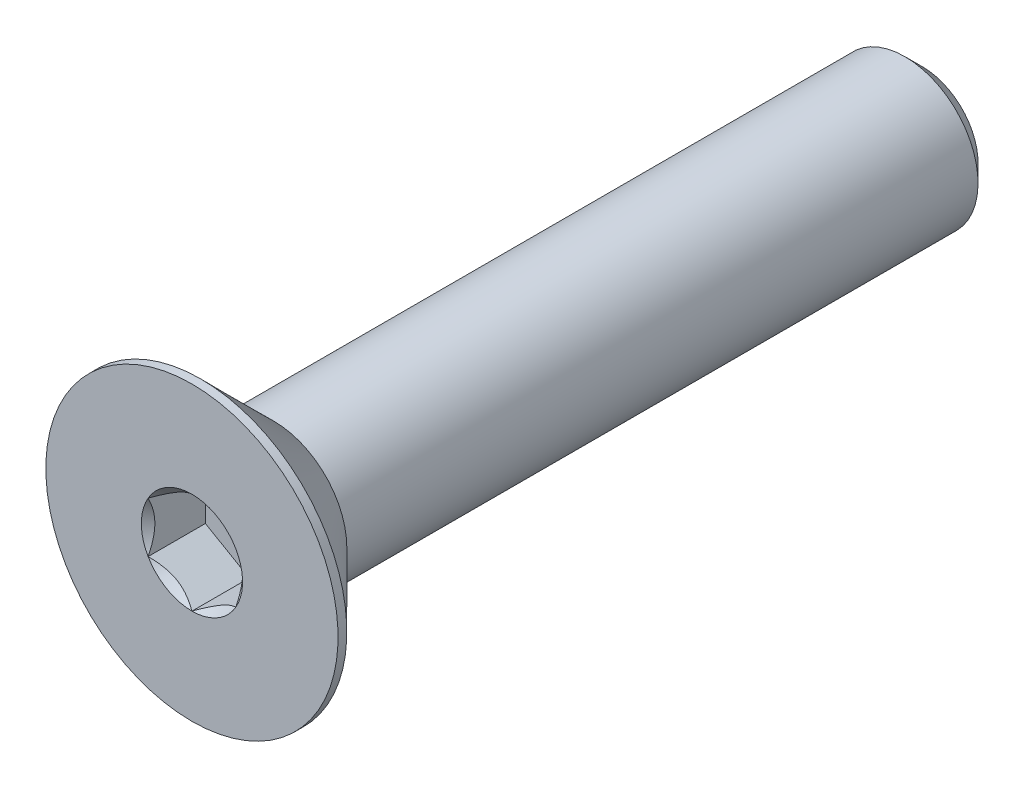
ISO-10303-21;
HEADER;
FILE_DESCRIPTION(('STEP AP214'),'2;1');
FILE_NAME('part.step','',(''),(''),'','','');
FILE_SCHEMA(('AUTOMOTIVE_DESIGN { 1 0 10303 214 1 1 1 1 }'));
ENDSEC;
DATA;
#1=APPLICATION_CONTEXT('core data for automotive mechanical design processes');
#2=APPLICATION_PROTOCOL_DEFINITION('international standard','automotive_design',2000,#1);
#3=PRODUCT_CONTEXT('',#1,'mechanical');
#4=PRODUCT('Part','Part','',(#3));
#5=PRODUCT_RELATED_PRODUCT_CATEGORY('part','',(#4));
#6=PRODUCT_DEFINITION_FORMATION('','',#4);
#7=PRODUCT_DEFINITION_CONTEXT('part definition',#1,'design');
#8=PRODUCT_DEFINITION('design','',#6,#7);
#9=PRODUCT_DEFINITION_SHAPE('','',#8);
#10=(LENGTH_UNIT() NAMED_UNIT(*) SI_UNIT(.MILLI.,.METRE.));
#11=(NAMED_UNIT(*) PLANE_ANGLE_UNIT() SI_UNIT($,.RADIAN.));
#12=(NAMED_UNIT(*) SI_UNIT($,.STERADIAN.) SOLID_ANGLE_UNIT());
#13=UNCERTAINTY_MEASURE_WITH_UNIT(LENGTH_MEASURE(1.E-05),#10,'distance_accuracy_value','');
#14=(GEOMETRIC_REPRESENTATION_CONTEXT(3) GLOBAL_UNCERTAINTY_ASSIGNED_CONTEXT((#13)) GLOBAL_UNIT_ASSIGNED_CONTEXT((#10,
#11,#12)) REPRESENTATION_CONTEXT('',''));
#15=CARTESIAN_POINT('',(0.,0.,0.));
#16=DIRECTION('',(0.,0.,1.));
#17=DIRECTION('',(1.,0.,0.));
#18=AXIS2_PLACEMENT_3D('',#15,#16,#17);
#19=CARTESIAN_POINT('',(0.,0.,-25.));
#20=DIRECTION('',(0.,0.,-1.));
#21=DIRECTION('',(0.,1.,0.));
#22=AXIS2_PLACEMENT_3D('',#19,#20,#21);
#23=CYLINDRICAL_SURFACE('',#22,2.5);
#24=CARTESIAN_POINT('',(0.,0.,-24.4));
#25=DIRECTION('',(0.,0.,-1.));
#26=DIRECTION('',(0.,1.,0.));
#27=AXIS2_PLACEMENT_3D('',#24,#25,#26);
#28=CIRCLE('',#27,2.5);
#29=CARTESIAN_POINT('',(0.,2.50000000000003,-24.4));
#30=VERTEX_POINT('',#29);
#31=EDGE_CURVE('E60',#30,#30,#28,.F.);
#32=CARTESIAN_POINT('',(0.,0.,-2.79999999999997));
#33=DIRECTION('',(0.,0.,1.));
#34=DIRECTION('',(0.,-1.,0.));
#35=AXIS2_PLACEMENT_3D('',#32,#33,#34);
#36=CIRCLE('',#35,2.50000000000001);
#37=CARTESIAN_POINT('',(0.,2.50000000000003,-2.79999999999997));
#38=VERTEX_POINT('',#37);
#39=EDGE_CURVE('E178',#38,#38,#36,.T.);
#40=CARTESIAN_POINT('',(0.,2.50000000000003,-24.4));
#41=CARTESIAN_POINT('',(0.,2.50000000000003,-24.175));
#42=CARTESIAN_POINT('',(0.,2.50000000000003,-23.95));
#43=CARTESIAN_POINT('',(0.,2.50000000000003,-23.5));
#44=CARTESIAN_POINT('',(0.,2.50000000000003,-23.275));
#45=CARTESIAN_POINT('',(0.,2.50000000000003,-22.825));
#46=CARTESIAN_POINT('',(0.,2.50000000000003,-22.6));
#47=CARTESIAN_POINT('',(0.,2.50000000000003,-22.15));
#48=CARTESIAN_POINT('',(0.,2.50000000000003,-21.925));
#49=CARTESIAN_POINT('',(0.,2.50000000000003,-21.475));
#50=CARTESIAN_POINT('',(0.,2.50000000000003,-21.25));
#51=CARTESIAN_POINT('',(0.,2.50000000000003,-20.8));
#52=CARTESIAN_POINT('',(0.,2.50000000000003,-20.575));
#53=CARTESIAN_POINT('',(0.,2.50000000000003,-20.125));
#54=CARTESIAN_POINT('',(0.,2.50000000000003,-19.9));
#55=CARTESIAN_POINT('',(0.,2.50000000000003,-19.45));
#56=CARTESIAN_POINT('',(0.,2.50000000000003,-19.225));
#57=CARTESIAN_POINT('',(0.,2.50000000000003,-18.775));
#58=CARTESIAN_POINT('',(0.,2.50000000000003,-18.55));
#59=CARTESIAN_POINT('',(0.,2.50000000000003,-18.1));
#60=CARTESIAN_POINT('',(0.,2.50000000000003,-17.875));
#61=CARTESIAN_POINT('',(0.,2.50000000000003,-17.425));
#62=CARTESIAN_POINT('',(0.,2.50000000000003,-17.2));
#63=CARTESIAN_POINT('',(0.,2.50000000000003,-16.75));
#64=CARTESIAN_POINT('',(0.,2.50000000000003,-16.525));
#65=CARTESIAN_POINT('',(0.,2.50000000000003,-16.075));
#66=CARTESIAN_POINT('',(0.,2.50000000000003,-15.85));
#67=CARTESIAN_POINT('',(0.,2.50000000000003,-15.4));
#68=CARTESIAN_POINT('',(0.,2.50000000000003,-15.175));
#69=CARTESIAN_POINT('',(0.,2.50000000000003,-14.725));
#70=CARTESIAN_POINT('',(0.,2.50000000000003,-14.5));
#71=CARTESIAN_POINT('',(0.,2.50000000000003,-14.05));
#72=CARTESIAN_POINT('',(0.,2.50000000000003,-13.825));
#73=CARTESIAN_POINT('',(0.,2.50000000000003,-13.375));
#74=CARTESIAN_POINT('',(0.,2.50000000000003,-13.15));
#75=CARTESIAN_POINT('',(0.,2.50000000000003,-12.7));
#76=CARTESIAN_POINT('',(0.,2.50000000000003,-12.475));
#77=CARTESIAN_POINT('',(0.,2.50000000000003,-12.025));
#78=CARTESIAN_POINT('',(0.,2.50000000000003,-11.8));
#79=CARTESIAN_POINT('',(0.,2.50000000000003,-11.35));
#80=CARTESIAN_POINT('',(0.,2.50000000000003,-11.125));
#81=CARTESIAN_POINT('',(0.,2.50000000000003,-10.675));
#82=CARTESIAN_POINT('',(0.,2.50000000000003,-10.45));
#83=CARTESIAN_POINT('',(0.,2.50000000000003,-9.99999999999998));
#84=CARTESIAN_POINT('',(0.,2.50000000000003,-9.77499999999998));
#85=CARTESIAN_POINT('',(0.,2.50000000000003,-9.32499999999998));
#86=CARTESIAN_POINT('',(0.,2.50000000000003,-9.09999999999998));
#87=CARTESIAN_POINT('',(0.,2.50000000000003,-8.64999999999998));
#88=CARTESIAN_POINT('',(0.,2.50000000000003,-8.42499999999998));
#89=CARTESIAN_POINT('',(0.,2.50000000000003,-7.97499999999997));
#90=CARTESIAN_POINT('',(0.,2.50000000000003,-7.74999999999997));
#91=CARTESIAN_POINT('',(0.,2.50000000000003,-7.29999999999997));
#92=CARTESIAN_POINT('',(0.,2.50000000000003,-7.07499999999998));
#93=CARTESIAN_POINT('',(0.,2.50000000000003,-6.62499999999998));
#94=CARTESIAN_POINT('',(0.,2.50000000000003,-6.39999999999998));
#95=CARTESIAN_POINT('',(0.,2.50000000000003,-5.94999999999998));
#96=CARTESIAN_POINT('',(0.,2.50000000000003,-5.72499999999997));
#97=CARTESIAN_POINT('',(0.,2.50000000000003,-5.27499999999997));
#98=CARTESIAN_POINT('',(0.,2.50000000000003,-5.04999999999997));
#99=CARTESIAN_POINT('',(0.,2.50000000000003,-4.59999999999997));
#100=CARTESIAN_POINT('',(0.,2.50000000000003,-4.37499999999998));
#101=CARTESIAN_POINT('',(0.,2.50000000000003,-3.92499999999998));
#102=CARTESIAN_POINT('',(0.,2.50000000000003,-3.69999999999998));
#103=CARTESIAN_POINT('',(0.,2.50000000000003,-3.24999999999997));
#104=CARTESIAN_POINT('',(0.,2.50000000000003,-3.02499999999997));
#105=CARTESIAN_POINT('',(0.,2.50000000000003,-2.79999999999997));
#106=B_SPLINE_CURVE_WITH_KNOTS('',3,(#40,#41,#42,#43,#44,#45,#46,#47,#48,#49,#50,#51,#52,#53,
#54,#55,#56,#57,#58,#59,#60,#61,#62,#63,#64,#65,#66,#67,#68,#69,#70,#71,#72,#73,#74,#75,#76,#77,
#78,#79,#80,#81,#82,#83,#84,#85,#86,#87,#88,#89,#90,#91,#92,#93,#94,#95,#96,#97,#98,#99,#100,
#101,#102,#103,#104,#105),.UNSPECIFIED.,.F.,.F.,(4,2,2,2,2,2,2,2,2,2,2,2,2,2,2,2,2,2,2,2,2,2,2,
2,2,2,2,2,2,2,2,2,4),(0.,0.675000000000002,1.35,2.025,2.7,3.375,4.05,4.725,5.4,6.075,6.75,7.425,
8.1,8.775,9.45,10.125,10.8,11.475,12.15,12.825,13.5,14.175,14.85,15.525,16.2,16.875,17.55,
18.225,18.9,19.575,20.25,20.925,21.6),.UNSPECIFIED.);
#107=EDGE_CURVE('BSEAM46',#30,#38,#106,.T.);
#108=ORIENTED_EDGE('',*,*,#31,.T.);
#109=ORIENTED_EDGE('',*,*,#39,.F.);
#110=ORIENTED_EDGE('',*,*,#107,.T.);
#111=ORIENTED_EDGE('',*,*,#107,.F.);
#112=EDGE_LOOP('',(#108,#110,#109,#111));
#113=FACE_BOUND('',#112,.T.);
#114=ADVANCED_FACE('F46',(#113),#23,.T.);
#115=CARTESIAN_POINT('',(0.,-2.5,-25.));
#116=DIRECTION('',(0.,0.,-1.));
#117=DIRECTION('',(0.,1.,0.));
#118=AXIS2_PLACEMENT_3D('',#115,#116,#117);
#119=PLANE('',#118);
#120=CARTESIAN_POINT('',(0.,0.,-25.));
#121=DIRECTION('',(0.,0.,-1.));
#122=DIRECTION('',(0.,1.,0.));
#123=AXIS2_PLACEMENT_3D('',#120,#121,#122);
#124=CIRCLE('',#123,1.90000000000001);
#125=CARTESIAN_POINT('',(0.,1.90000000000003,-25.));
#126=VERTEX_POINT('',#125);
#127=EDGE_CURVE('E187',#126,#126,#124,.T.);
#128=ORIENTED_EDGE('',*,*,#127,.T.);
#129=EDGE_LOOP('',(#128));
#130=FACE_BOUND('',#129,.T.);
#131=ADVANCED_FACE('F197',(#130),#119,.T.);
#132=CARTESIAN_POINT('',(0.,0.,-25.));
#133=DIRECTION('',(0.,0.,1.));
#134=DIRECTION('',(0.,-1.,0.));
#135=AXIS2_PLACEMENT_3D('',#132,#133,#134);
#136=CONICAL_SURFACE('',#135,1.90000000000001,0.785398163397448);
#137=ORIENTED_EDGE('',*,*,#31,.F.);
#138=EDGE_LOOP('',(#137));
#139=FACE_BOUND('',#138,.T.);
#140=ORIENTED_EDGE('',*,*,#127,.F.);
#141=EDGE_LOOP('',(#140));
#142=FACE_BOUND('',#141,.T.);
#143=ADVANCED_FACE('F48',(#139,#142),#136,.T.);
#144=CARTESIAN_POINT('',(0.,0.,0.));
#145=DIRECTION('',(0.,0.,1.));
#146=DIRECTION('',(0.,-1.,0.));
#147=AXIS2_PLACEMENT_3D('',#144,#145,#146);
#148=CYLINDRICAL_SURFACE('',#147,5.);
#149=CARTESIAN_POINT('',(0.,0.,0.));
#150=DIRECTION('',(0.,0.,1.));
#151=DIRECTION('',(0.,-1.,0.));
#152=AXIS2_PLACEMENT_3D('',#149,#150,#151);
#153=CIRCLE('',#152,5.);
#154=CARTESIAN_POINT('',(0.,-5.,0.));
#155=VERTEX_POINT('',#154);
#156=EDGE_CURVE('E184',#155,#155,#153,.T.);
#157=CARTESIAN_POINT('',(0.,0.,-0.300000000000022));
#158=DIRECTION('',(0.,0.,1.));
#159=DIRECTION('',(0.,-1.,0.));
#160=AXIS2_PLACEMENT_3D('',#157,#158,#159);
#161=CIRCLE('',#160,5.);
#162=CARTESIAN_POINT('',(0.,-5.,-0.300000000000017));
#163=VERTEX_POINT('',#162);
#164=EDGE_CURVE('E181',#163,#163,#161,.T.);
#165=CARTESIAN_POINT('',(0.,-5.,0.));
#166=CARTESIAN_POINT('',(0.,-5.,-0.00312499999999512));
#167=CARTESIAN_POINT('',(0.,-5.,-0.00624999999999535));
#168=CARTESIAN_POINT('',(0.,-5.,-0.0124999999999958));
#169=CARTESIAN_POINT('',(0.,-5.,-0.0156249999999961));
#170=CARTESIAN_POINT('',(0.,-5.,-0.0218749999999965));
#171=CARTESIAN_POINT('',(0.,-5.,-0.0249999999999968));
#172=CARTESIAN_POINT('',(0.,-5.,-0.0312499999999972));
#173=CARTESIAN_POINT('',(0.,-5.,-0.0343749999999975));
#174=CARTESIAN_POINT('',(0.,-5.,-0.0406249999999979));
#175=CARTESIAN_POINT('',(0.,-5.,-0.0437499999999982));
#176=CARTESIAN_POINT('',(0.,-5.,-0.0499999999999986));
#177=CARTESIAN_POINT('',(0.,-5.,-0.0531249999999989));
#178=CARTESIAN_POINT('',(0.,-5.,-0.0593749999999993));
#179=CARTESIAN_POINT('',(0.,-5.,-0.0624999999999996));
#180=CARTESIAN_POINT('',(0.,-5.,-0.06875));
#181=CARTESIAN_POINT('',(0.,-5.,-0.0718750000000003));
#182=CARTESIAN_POINT('',(0.,-5.,-0.0781250000000007));
#183=CARTESIAN_POINT('',(0.,-5.,-0.081250000000001));
#184=CARTESIAN_POINT('',(0.,-5.,-0.0875000000000014));
#185=CARTESIAN_POINT('',(0.,-5.,-0.0906250000000017));
#186=CARTESIAN_POINT('',(0.,-5.,-0.0968750000000021));
#187=CARTESIAN_POINT('',(0.,-5.,-0.100000000000002));
#188=CARTESIAN_POINT('',(0.,-5.,-0.106250000000003));
#189=CARTESIAN_POINT('',(0.,-5.,-0.109375000000003));
#190=CARTESIAN_POINT('',(0.,-5.,-0.115625000000004));
#191=CARTESIAN_POINT('',(0.,-5.,-0.118750000000004));
#192=CARTESIAN_POINT('',(0.,-5.,-0.125000000000004));
#193=CARTESIAN_POINT('',(0.,-5.,-0.128125000000004));
#194=CARTESIAN_POINT('',(0.,-5.,-0.134375000000005));
#195=CARTESIAN_POINT('',(0.,-5.,-0.137500000000005));
#196=CARTESIAN_POINT('',(0.,-5.,-0.143750000000006));
#197=CARTESIAN_POINT('',(0.,-5.,-0.146875000000006));
#198=CARTESIAN_POINT('',(0.,-5.,-0.153125000000006));
#199=CARTESIAN_POINT('',(0.,-5.,-0.156250000000007));
#200=CARTESIAN_POINT('',(0.,-5.,-0.162500000000007));
#201=CARTESIAN_POINT('',(0.,-5.,-0.165625000000007));
#202=CARTESIAN_POINT('',(0.,-5.,-0.171875000000008));
#203=CARTESIAN_POINT('',(0.,-5.,-0.175000000000008));
#204=CARTESIAN_POINT('',(0.,-5.,-0.181250000000008));
#205=CARTESIAN_POINT('',(0.,-5.,-0.184375000000009));
#206=CARTESIAN_POINT('',(0.,-5.,-0.190625000000009));
#207=CARTESIAN_POINT('',(0.,-5.,-0.193750000000009));
#208=CARTESIAN_POINT('',(0.,-5.,-0.20000000000001));
#209=CARTESIAN_POINT('',(0.,-5.,-0.20312500000001));
#210=CARTESIAN_POINT('',(0.,-5.,-0.209375000000011));
#211=CARTESIAN_POINT('',(0.,-5.,-0.212500000000011));
#212=CARTESIAN_POINT('',(0.,-5.,-0.218750000000011));
#213=CARTESIAN_POINT('',(0.,-5.,-0.221875000000011));
#214=CARTESIAN_POINT('',(0.,-5.,-0.228125000000012));
#215=CARTESIAN_POINT('',(0.,-5.,-0.231250000000012));
#216=CARTESIAN_POINT('',(0.,-5.,-0.237500000000013));
#217=CARTESIAN_POINT('',(0.,-5.,-0.240625000000013));
#218=CARTESIAN_POINT('',(0.,-5.,-0.246875000000013));
#219=CARTESIAN_POINT('',(0.,-5.,-0.250000000000014));
#220=CARTESIAN_POINT('',(0.,-5.,-0.256250000000014));
#221=CARTESIAN_POINT('',(0.,-5.,-0.259375000000014));
#222=CARTESIAN_POINT('',(0.,-5.,-0.265625000000015));
#223=CARTESIAN_POINT('',(0.,-5.,-0.268750000000015));
#224=CARTESIAN_POINT('',(0.,-5.,-0.275000000000016));
#225=CARTESIAN_POINT('',(0.,-5.,-0.278125000000016));
#226=CARTESIAN_POINT('',(0.,-5.,-0.284375000000016));
#227=CARTESIAN_POINT('',(0.,-5.,-0.287500000000016));
#228=CARTESIAN_POINT('',(0.,-5.,-0.293750000000017));
#229=CARTESIAN_POINT('',(0.,-5.,-0.296875000000017));
#230=CARTESIAN_POINT('',(0.,-5.,-0.300000000000017));
#231=B_SPLINE_CURVE_WITH_KNOTS('',3,(#165,#166,#167,#168,#169,#170,#171,#172,#173,#174,#175,
#176,#177,#178,#179,#180,#181,#182,#183,#184,#185,#186,#187,#188,#189,#190,#191,#192,#193,#194,
#195,#196,#197,#198,#199,#200,#201,#202,#203,#204,#205,#206,#207,#208,#209,#210,#211,#212,#213,
#214,#215,#216,#217,#218,#219,#220,#221,#222,#223,#224,#225,#226,#227,#228,#229,#230),
.UNSPECIFIED.,.F.,.F.,(4,2,2,2,2,2,2,2,2,2,2,2,2,2,2,2,2,2,2,2,2,2,2,2,2,2,2,2,2,2,2,2,4),(0.,
0.0093750000000007,0.0187500000000014,0.0281250000000021,0.0375000000000028,0.0468750000000035,
0.0562500000000042,0.0656250000000049,0.0750000000000056,0.0843750000000063,0.093750000000007,
0.103125000000008,0.112500000000008,0.121875000000009,0.13125000000001,0.140625000000011,
0.150000000000011,0.159375000000012,0.168750000000013,0.178125000000013,0.187500000000014,
0.196875000000015,0.206250000000015,0.215625000000016,0.225000000000017,0.234375000000018,
0.243750000000018,0.253125000000019,0.26250000000002,0.27187500000002,0.281250000000021,
0.290625000000022,0.300000000000022),.UNSPECIFIED.);
#232=EDGE_CURVE('BSEAM196',#155,#163,#231,.T.);
#233=ORIENTED_EDGE('',*,*,#156,.F.);
#234=ORIENTED_EDGE('',*,*,#164,.T.);
#235=ORIENTED_EDGE('',*,*,#232,.T.);
#236=ORIENTED_EDGE('',*,*,#232,.F.);
#237=EDGE_LOOP('',(#233,#235,#234,#236));
#238=FACE_BOUND('',#237,.T.);
#239=ADVANCED_FACE('F196',(#238),#148,.T.);
#240=CARTESIAN_POINT('',(0.,0.,-2.79999999999997));
#241=DIRECTION('',(0.,0.,1.));
#242=DIRECTION('',(0.,-1.,0.));
#243=AXIS2_PLACEMENT_3D('',#240,#241,#242);
#244=CONICAL_SURFACE('',#243,2.50000000000001,0.78539816339745);
#245=ORIENTED_EDGE('',*,*,#164,.F.);
#246=EDGE_LOOP('',(#245));
#247=FACE_BOUND('',#246,.T.);
#248=ORIENTED_EDGE('',*,*,#39,.T.);
#249=EDGE_LOOP('',(#248));
#250=FACE_BOUND('',#249,.T.);
#251=ADVANCED_FACE('F207',(#247,#250),#244,.T.);
#252=CARTESIAN_POINT('',(0.,-2.5,0.));
#253=DIRECTION('',(0.,0.,1.));
#254=DIRECTION('',(0.,-1.,0.));
#255=AXIS2_PLACEMENT_3D('',#252,#253,#254);
#256=PLANE('',#255);
#257=CARTESIAN_POINT('',(0.,0.,0.));
#258=DIRECTION('',(0.,0.,1.));
#259=DIRECTION('',(1.,0.,0.));
#260=AXIS2_PLACEMENT_3D('',#257,#258,#259);
#261=CIRCLE('',#260,1.73205080756888);
#262=CARTESIAN_POINT('',(0.,-1.73205080756884,0.));
#263=VERTEX_POINT('',#262);
#264=CARTESIAN_POINT('',(1.49999999999997,-0.866025403784415,0.));
#265=VERTEX_POINT('',#264);
#266=EDGE_CURVE('E106',#263,#265,#261,.T.);
#267=ORIENTED_EDGE('',*,*,#266,.F.);
#268=CARTESIAN_POINT('',(-1.49999999999997,-0.866025403784443,0.));
#269=VERTEX_POINT('',#268);
#270=EDGE_CURVE('E66',#269,#263,#261,.T.);
#271=ORIENTED_EDGE('',*,*,#270,.F.);
#272=CARTESIAN_POINT('',(-1.50000000000003,0.866025403784471,0.));
#273=VERTEX_POINT('',#272);
#274=EDGE_CURVE('E148',#273,#269,#261,.T.);
#275=ORIENTED_EDGE('',*,*,#274,.F.);
#276=CARTESIAN_POINT('',(0.,1.73205080756891,0.));
#277=VERTEX_POINT('',#276);
#278=EDGE_CURVE('E73',#277,#273,#261,.T.);
#279=ORIENTED_EDGE('',*,*,#278,.F.);
#280=CARTESIAN_POINT('',(1.49999999999997,0.866025403784471,0.));
#281=VERTEX_POINT('',#280);
#282=EDGE_CURVE('E142',#281,#277,#261,.T.);
#283=ORIENTED_EDGE('',*,*,#282,.F.);
#284=EDGE_CURVE('E114',#265,#281,#261,.T.);
#285=ORIENTED_EDGE('',*,*,#284,.F.);
#286=EDGE_LOOP('',(#267,#271,#275,#279,#283,#285));
#287=FACE_BOUND('',#286,.T.);
#288=ORIENTED_EDGE('',*,*,#156,.T.);
#289=EDGE_LOOP('',(#288));
#290=FACE_BOUND('',#289,.T.);
#291=ADVANCED_FACE('F140',(#287,#290),#256,.T.);
#292=CARTESIAN_POINT('',(0.,0.,0.));
#293=DIRECTION('',(0.,0.,1.));
#294=DIRECTION('',(1.,0.,0.));
#295=AXIS2_PLACEMENT_3D('',#292,#293,#294);
#296=CONICAL_SURFACE('',#295,1.73205080756888,0.78539816339745);
#297=ORIENTED_EDGE('',*,*,#284,.T.);
#298=CARTESIAN_POINT('',(1.49999999999992,-1.7272081296969,0.555578516270749));
#299=CARTESIAN_POINT('',(1.4999999999999,-1.68515175699266,0.523829907857362));
#300=CARTESIAN_POINT('',(1.49999999999989,-1.64286104748672,0.492392593807306));
#301=CARTESIAN_POINT('',(1.49999999999989,-1.55771581035941,0.430269087556319));
#302=CARTESIAN_POINT('',(1.49999999999989,-1.51486114386666,0.39958308589211));
#303=CARTESIAN_POINT('',(1.49999999999989,-1.38468134151268,0.308407192427072));
#304=CARTESIAN_POINT('',(1.4999999999999,-1.29637976071652,0.249288343426689));
#305=CARTESIAN_POINT('',(1.49999999999988,-1.11121478730467,0.133230996316403));
#306=CARTESIAN_POINT('',(1.49999999999986,-1.01415038238168,0.076609558732883));
#307=CARTESIAN_POINT('',(1.49999999999992,-0.815173408897587,-0.0269631187344146));
#308=CARTESIAN_POINT('',(1.50000000000002,-0.713278669253228,-0.0739469584583163));
#309=CARTESIAN_POINT('',(1.49999999999995,-0.560333774943062,-0.131427331569222));
#310=CARTESIAN_POINT('',(1.49999999999991,-0.511547982948004,-0.147924612242851));
#311=CARTESIAN_POINT('',(1.49999999999988,-0.412798620136834,-0.177002487073126));
#312=CARTESIAN_POINT('',(1.49999999999989,-0.362834968437524,-0.189582811406095));
#313=CARTESIAN_POINT('',(1.49999999999989,-0.262863235444938,-0.209963805853348));
#314=CARTESIAN_POINT('',(1.49999999999986,-0.212872113807978,-0.217846367254157));
#315=CARTESIAN_POINT('',(1.49999999999992,-0.112355243569493,-0.228677936031088));
#316=CARTESIAN_POINT('',(1.5,-0.0618295883725674,-0.231627791475674));
#317=CARTESIAN_POINT('',(1.5,0.0374291733324539,-0.232375142275173));
#318=CARTESIAN_POINT('',(1.49999999999992,0.0861609672003699,-0.230355266442008));
#319=CARTESIAN_POINT('',(1.49999999999986,0.183206937768894,-0.221677447103365));
#320=CARTESIAN_POINT('',(1.49999999999989,0.231521073438332,-0.215019053031647));
#321=CARTESIAN_POINT('',(1.49999999999989,0.328199853425492,-0.197314755877524));
#322=CARTESIAN_POINT('',(1.49999999999988,0.376550616310382,-0.186194188743062));
#323=CARTESIAN_POINT('',(1.49999999999991,0.472195697125641,-0.160156585951373));
#324=CARTESIAN_POINT('',(1.49999999999995,0.519490103092774,-0.145239867959124));
#325=CARTESIAN_POINT('',(1.50000000000002,0.668391282696648,-0.0926647764039492));
#326=CARTESIAN_POINT('',(1.49999999999992,0.767878709508593,-0.0490187125280854));
#327=CARTESIAN_POINT('',(1.49999999999986,0.962179866690772,0.0480229945930116));
#328=CARTESIAN_POINT('',(1.49999999999988,1.05697519961448,0.101453665089462));
#329=CARTESIAN_POINT('',(1.4999999999999,1.23814273533386,0.211685852004496));
#330=CARTESIAN_POINT('',(1.4999999999999,1.32469942181292,0.268187920698531));
#331=CARTESIAN_POINT('',(1.49999999999989,1.45222331290676,0.355534301578598));
#332=CARTESIAN_POINT('',(1.49999999999988,1.49418091978758,0.384957758679985));
#333=CARTESIAN_POINT('',(1.4999999999999,1.5775227293148,0.444582821830408));
#334=CARTESIAN_POINT('',(1.49999999999992,1.61890708647358,0.474784211664379));
#335=CARTESIAN_POINT('',(1.49999999999997,1.66005278019499,0.505308178609387));
#336=B_SPLINE_CURVE_WITH_KNOTS('',3,(#298,#299,#300,#301,#302,#303,#304,#305,#306,#307,#308,
#309,#310,#311,#312,#313,#314,#315,#316,#317,#318,#319,#320,#321,#322,#323,#324,#325,#326,#327,
#328,#329,#330,#331,#332,#333,#334,#335),.UNSPECIFIED.,.F.,.F.,(4,2,2,2,2,2,2,2,2,2,2,2,2,2,2,2,
2,2,4),(0.,0.158079548982684,0.316198780993969,0.634850417346976,0.971690311361521,
1.3073713166067,1.46173961127093,1.61611853740682,1.76772101421415,1.91929742368545,
2.06538741209607,2.2114915930555,2.36014984633877,2.50879566386714,2.83376031422678,
3.15991186985656,3.46985601802201,3.62358896039978,3.77727962642076),.UNSPECIFIED.);
#337=EDGE_CURVE('E13',#265,#281,#336,.T.);
#338=ORIENTED_EDGE('',*,*,#337,.F.);
#339=EDGE_LOOP('',(#297,#338));
#340=FACE_BOUND('',#339,.T.);
#341=ADVANCED_FACE('F118',(#340),#296,.F.);
#342=ORIENTED_EDGE('',*,*,#282,.T.);
#343=CARTESIAN_POINT('',(1.50019999999998,0.865909933730619,0.000115481600004852));
#344=CARTESIAN_POINT('',(1.44863220926289,0.895682611594185,-0.0296345239327032));
#345=CARTESIAN_POINT('',(1.39620208233477,0.925953159489784,-0.0576375160897062));
#346=CARTESIAN_POINT('',(1.28929096594437,0.987678321317144,-0.108910769559871));
#347=CARTESIAN_POINT('',(1.2347998041853,1.0191388082272,-0.132152494955647));
#348=CARTESIAN_POINT('',(1.12492091864271,1.08257741237347,-0.17196627100779));
#349=CARTESIAN_POINT('',(1.06956119090475,1.11453936608524,-0.188638414329098));
#350=CARTESIAN_POINT('',(0.957622742522797,1.17916705939124,-0.214325543181926));
#351=CARTESIAN_POINT('',(0.901047443446947,1.21183082354217,-0.223359709521213));
#352=CARTESIAN_POINT('',(0.803544610483519,1.26812411040035,-0.231510918773204));
#353=CARTESIAN_POINT('',(0.762743091719495,1.2916808782421,-0.232717747010797));
#354=CARTESIAN_POINT('',(0.681212030384108,1.3387528584514,-0.230685942837717));
#355=CARTESIAN_POINT('',(0.640482505685341,1.3622680605002,-0.227446329251689));
#356=CARTESIAN_POINT('',(0.559415597836559,1.40907206156906,-0.216708014018034));
#357=CARTESIAN_POINT('',(0.519078615401688,1.43236062923612,-0.20920534698125));
#358=CARTESIAN_POINT('',(0.439081663085963,1.47854689118999,-0.19034838807172));
#359=CARTESIAN_POINT('',(0.399421991483804,1.50144441326552,-0.178992442981465));
#360=CARTESIAN_POINT('',(0.297836865225541,1.56009461325642,-0.145278352407404));
#361=CARTESIAN_POINT('',(0.236541446290321,1.59548353987868,-0.120378150906646));
#362=CARTESIAN_POINT('',(0.146414371536687,1.64751843074893,-0.0783433467284195));
#363=CARTESIAN_POINT('',(0.116714860092281,1.66466545167616,-0.0635748464409057));
#364=CARTESIAN_POINT('',(0.0578620986162533,1.69864410935691,-0.0326894340598314));
#365=CARTESIAN_POINT('',(0.0287085957793738,1.71547589206761,-0.0165731658782819));
#366=CARTESIAN_POINT('',(-0.000199999999977996,1.73216627762271,0.000115481600115874));
#367=B_SPLINE_CURVE_WITH_KNOTS('',3,(#343,#344,#345,#346,#347,#348,#349,#350,#351,#352,#353,
#354,#355,#356,#357,#358,#359,#360,#361,#362,#363,#364,#365,#366),.UNSPECIFIED.,.F.,.F.,(4,2,2,
2,2,2,2,2,2,2,2,4),(0.,0.19982914369329,0.400822987382385,0.598623720538192,0.795926240188902,
0.937113067959876,1.07833105577191,1.21968061668219,1.3610908993105,1.58570969637561,
1.69770705470959,1.8096512073719),.UNSPECIFIED.);
#368=EDGE_CURVE('E144',#281,#277,#367,.T.);
#369=ORIENTED_EDGE('',*,*,#368,.F.);
#370=EDGE_LOOP('',(#342,#369));
#371=FACE_BOUND('',#370,.T.);
#372=ADVANCED_FACE('F288',(#371),#296,.F.);
#373=ORIENTED_EDGE('',*,*,#278,.T.);
#374=CARTESIAN_POINT('',(0.00019999999995024,1.73216627762277,0.000115481600115874));
#375=CARTESIAN_POINT('',(-0.0513677907371143,1.70239359975919,-0.0296345239326362));
#376=CARTESIAN_POINT('',(-0.103797917665236,1.67212305186358,-0.0576375160896532));
#377=CARTESIAN_POINT('',(-0.210709034055631,1.61039789003622,-0.108910769559823));
#378=CARTESIAN_POINT('',(-0.265200195814697,1.57893740312617,-0.132152494955591));
#379=CARTESIAN_POINT('',(-0.375079081357282,1.5154987989799,-0.171966271007741));
#380=CARTESIAN_POINT('',(-0.430438809095228,1.48353684526813,-0.188638414329064));
#381=CARTESIAN_POINT('',(-0.542377257477187,1.41890915196215,-0.214325543181854));
#382=CARTESIAN_POINT('',(-0.598952556553058,1.38624538781125,-0.223359709521089));
#383=CARTESIAN_POINT('',(-0.696455389516483,1.32995210095305,-0.231510918773102));
#384=CARTESIAN_POINT('',(-0.737256908280496,1.30639533311128,-0.232717747010739));
#385=CARTESIAN_POINT('',(-0.818787969615875,1.25932335290197,-0.230685942837689));
#386=CARTESIAN_POINT('',(-0.859517494314645,1.23580815085317,-0.227446329251648));
#387=CARTESIAN_POINT('',(-0.94058440216343,1.18900414978431,-0.216708014017997));
#388=CARTESIAN_POINT('',(-0.980921384598302,1.16571558211725,-0.209205346981229));
#389=CARTESIAN_POINT('',(-1.06091833691403,1.1195293201634,-0.190348388071668));
#390=CARTESIAN_POINT('',(-1.10057800851619,1.09663179808789,-0.178992442981366));
#391=CARTESIAN_POINT('',(-1.20216313477446,1.03798159809701,-0.145278352407277));
#392=CARTESIAN_POINT('',(-1.26345855370968,1.0025926714747,-0.120378150906596));
#393=CARTESIAN_POINT('',(-1.35358562846331,0.950557780604431,-0.0783433467283981));
#394=CARTESIAN_POINT('',(-1.38328513990772,0.933410759677204,-0.0635748464408799));
#395=CARTESIAN_POINT('',(-1.44213790138374,0.899432101996459,-0.0326894340598038));
#396=CARTESIAN_POINT('',(-1.47129140422062,0.882600319285758,-0.0165731658782569));
#397=CARTESIAN_POINT('',(-1.50019999999998,0.865909933730646,0.000115481600115874));
#398=B_SPLINE_CURVE_WITH_KNOTS('',3,(#374,#375,#376,#377,#378,#379,#380,#381,#382,#383,#384,
#385,#386,#387,#388,#389,#390,#391,#392,#393,#394,#395,#396,#397),.UNSPECIFIED.,.F.,.F.,(4,2,2,
2,2,2,2,2,2,2,2,4),(0.,0.199829143693305,0.400822987382387,0.598623720538176,0.795926240188883,
0.937113067959865,1.0783310557719,1.21968061668218,1.3610908993105,1.58570969637561,
1.69770705470958,1.80965120737188),.UNSPECIFIED.);
#399=EDGE_CURVE('E147',#277,#273,#398,.T.);
#400=ORIENTED_EDGE('',*,*,#399,.F.);
#401=EDGE_LOOP('',(#373,#400));
#402=FACE_BOUND('',#401,.T.);
#403=ADVANCED_FACE('F284',(#402),#296,.F.);
#404=ORIENTED_EDGE('',*,*,#274,.T.);
#405=CARTESIAN_POINT('',(-1.5,-1.7272081296969,0.55557851627086));
#406=CARTESIAN_POINT('',(-1.50000000000004,-1.68515175699267,0.523829907857475));
#407=CARTESIAN_POINT('',(-1.50000000000005,-1.64286104748673,0.492392593807422));
#408=CARTESIAN_POINT('',(-1.50000000000006,-1.55771581035942,0.430269087556441));
#409=CARTESIAN_POINT('',(-1.50000000000006,-1.51486114386668,0.399583085892236));
#410=CARTESIAN_POINT('',(-1.50000000000005,-1.38468134151269,0.308407192427197));
#411=CARTESIAN_POINT('',(-1.50000000000005,-1.29637976071652,0.249288343426806));
#412=CARTESIAN_POINT('',(-1.50000000000006,-1.11121478730465,0.133230996316535));
#413=CARTESIAN_POINT('',(-1.50000000000007,-1.01415038238164,0.0766095587330401));
#414=CARTESIAN_POINT('',(-1.50000000000004,-0.815173408897565,-0.0269631187343208));
#415=CARTESIAN_POINT('',(-1.50000000000002,-0.713278669253242,-0.0739469584583114));
#416=CARTESIAN_POINT('',(-1.50000000000004,-0.560333774943063,-0.131427331569141));
#417=CARTESIAN_POINT('',(-1.50000000000005,-0.511547982947995,-0.147924612242714));
#418=CARTESIAN_POINT('',(-1.50000000000006,-0.412798620136824,-0.177002487072952));
#419=CARTESIAN_POINT('',(-1.50000000000006,-0.362834968437523,-0.189582811405937));
#420=CARTESIAN_POINT('',(-1.50000000000006,-0.262863235444949,-0.209963805853179));
#421=CARTESIAN_POINT('',(-1.50000000000006,-0.212872113807992,-0.217846367253962));
#422=CARTESIAN_POINT('',(-1.50000000000005,-0.112355243569523,-0.228677936030949));
#423=CARTESIAN_POINT('',(-1.50000000000003,-0.0618295883726105,-0.231627791475618));
#424=CARTESIAN_POINT('',(-1.50000000000003,0.0374291733323968,-0.232375142275118));
#425=CARTESIAN_POINT('',(-1.50000000000005,0.086160967200312,-0.230355266441874));
#426=CARTESIAN_POINT('',(-1.50000000000006,0.183206937768842,-0.221677447103178));
#427=CARTESIAN_POINT('',(-1.50000000000006,0.231521073438285,-0.215019053031484));
#428=CARTESIAN_POINT('',(-1.50000000000006,0.328199853425456,-0.197314755877376));
#429=CARTESIAN_POINT('',(-1.50000000000007,0.376550616310351,-0.186194188742902));
#430=CARTESIAN_POINT('',(-1.50000000000005,0.472195697125624,-0.160156585951227));
#431=CARTESIAN_POINT('',(-1.50000000000001,0.519490103092768,-0.145239867959002));
#432=CARTESIAN_POINT('',(-1.49999999999997,0.668391282696652,-0.0926647764038648));
#433=CARTESIAN_POINT('',(-1.50000000000003,0.767878709508581,-0.0490187125279621));
#434=CARTESIAN_POINT('',(-1.50000000000008,0.962179866690752,0.0480229945931596));
#435=CARTESIAN_POINT('',(-1.50000000000006,1.05697519961447,0.101453665089596));
#436=CARTESIAN_POINT('',(-1.50000000000005,1.23814273533385,0.211685852004619));
#437=CARTESIAN_POINT('',(-1.50000000000005,1.32469942181292,0.268187920698654));
#438=CARTESIAN_POINT('',(-1.50000000000006,1.45222331290675,0.355534301578715));
#439=CARTESIAN_POINT('',(-1.50000000000006,1.49418091978758,0.384957758680098));
#440=CARTESIAN_POINT('',(-1.50000000000005,1.57752272931478,0.444582821830515));
#441=CARTESIAN_POINT('',(-1.50000000000004,1.61890708647356,0.474784211664485));
#442=CARTESIAN_POINT('',(-1.5,1.66005278019496,0.505308178609498));
#443=B_SPLINE_CURVE_WITH_KNOTS('',3,(#405,#406,#407,#408,#409,#410,#411,#412,#413,#414,#415,
#416,#417,#418,#419,#420,#421,#422,#423,#424,#425,#426,#427,#428,#429,#430,#431,#432,#433,#434,
#435,#436,#437,#438,#439,#440,#441,#442),.UNSPECIFIED.,.F.,.F.,(4,2,2,2,2,2,2,2,2,2,2,2,2,2,2,2,
2,2,4),(0.,0.158079548982671,0.316198780993947,0.634850417346974,0.971690311361544,
1.30737131660672,1.46173961127092,1.6161185374068,1.76772101421411,1.91929742368539,
2.06538741209601,2.21149159305545,2.36014984633874,2.50879566386712,2.83376031422676,
3.15991186985654,3.46985601802199,3.62358896039975,3.77727962642071),.UNSPECIFIED.);
#444=EDGE_CURVE('E154',#273,#269,#443,.F.);
#445=ORIENTED_EDGE('',*,*,#444,.F.);
#446=EDGE_LOOP('',(#404,#445));
#447=FACE_BOUND('',#446,.T.);
#448=ADVANCED_FACE('F152',(#447),#296,.F.);
#449=ORIENTED_EDGE('',*,*,#270,.T.);
#450=CARTESIAN_POINT('',(-1.50020000000001,-0.865909933730591,0.000115481600115874));
#451=CARTESIAN_POINT('',(-1.44863220926294,-0.895682611594172,-0.0296345239326382));
#452=CARTESIAN_POINT('',(-1.39620208233482,-0.925953159489777,-0.0576375160896599));
#453=CARTESIAN_POINT('',(-1.28929096594442,-0.987678321317142,-0.108910769559839));
#454=CARTESIAN_POINT('',(-1.23479980418535,-1.01913880822719,-0.132152494955611));
#455=CARTESIAN_POINT('',(-1.12492091864275,-1.08257741237347,-0.17196627100776));
#456=CARTESIAN_POINT('',(-1.0695611909048,-1.11453936608525,-0.188638414329077));
#457=CARTESIAN_POINT('',(-0.95762274252284,-1.17916705939122,-0.214325543181888));
#458=CARTESIAN_POINT('',(-0.901047443446973,-1.21183082354214,-0.22335970952115));
#459=CARTESIAN_POINT('',(-0.803544610483548,-1.26812411040033,-0.231510918773153));
#460=CARTESIAN_POINT('',(-0.762743091719535,-1.2916808782421,-0.232717747010769));
#461=CARTESIAN_POINT('',(-0.681212030384155,-1.3387528584514,-0.230685942837704));
#462=CARTESIAN_POINT('',(-0.640482505685383,-1.3622680605002,-0.22744632925167));
#463=CARTESIAN_POINT('',(-0.559415597836608,-1.40907206156907,-0.216708014018019));
#464=CARTESIAN_POINT('',(-0.519078615401748,-1.43236062923615,-0.209205346981245));
#465=CARTESIAN_POINT('',(-0.439081663085991,-1.47854689118996,-0.190348388071697));
#466=CARTESIAN_POINT('',(-0.399421991483788,-1.5014444132654,-0.178992442981415));
#467=CARTESIAN_POINT('',(-0.297836865225492,-1.56009461325625,-0.145278352407339));
#468=CARTESIAN_POINT('',(-0.23654144629033,-1.59548353987865,-0.120378150906628));
#469=CARTESIAN_POINT('',(-0.14641437153672,-1.64751843074896,-0.0783433467284088));
#470=CARTESIAN_POINT('',(-0.116714860092313,-1.66466545167619,-0.0635748464408879));
#471=CARTESIAN_POINT('',(-0.0578620986162659,-1.69864410935692,-0.0326894340598222));
#472=CARTESIAN_POINT('',(-0.0287085957793687,-1.7154758920676,-0.0165731658782884));
#473=CARTESIAN_POINT('',(0.000200000000005751,-1.73216627762271,0.000115481600060363));
#474=B_SPLINE_CURVE_WITH_KNOTS('',3,(#450,#451,#452,#453,#454,#455,#456,#457,#458,#459,#460,
#461,#462,#463,#464,#465,#466,#467,#468,#469,#470,#471,#472,#473),.UNSPECIFIED.,.F.,.F.,(4,2,2,
2,2,2,2,2,2,2,2,4),(0.,0.199829143693314,0.400822987382418,0.598623720538219,0.795926240188932,
0.937113067959907,1.07833105577194,1.21968061668222,1.36109089931053,1.58570969637566,
1.69770705470964,1.80965120737195),.UNSPECIFIED.);
#475=EDGE_CURVE('E130',#269,#263,#474,.T.);
#476=ORIENTED_EDGE('',*,*,#475,.F.);
#477=EDGE_LOOP('',(#449,#476));
#478=FACE_BOUND('',#477,.T.);
#479=ADVANCED_FACE('F236',(#478),#296,.F.);
#480=ORIENTED_EDGE('',*,*,#266,.T.);
#481=CARTESIAN_POINT('',(-0.000200000000005751,-1.73216627762267,0.000115481600060363));
#482=CARTESIAN_POINT('',(0.0513677907370897,-1.70239359975914,-0.0296345239326626));
#483=CARTESIAN_POINT('',(0.103797917665219,-1.67212305186356,-0.0576375160896734));
#484=CARTESIAN_POINT('',(0.210709034055618,-1.61039789003621,-0.108910769559846));
#485=CARTESIAN_POINT('',(0.265200195814682,-1.57893740312615,-0.132152494955621));
#486=CARTESIAN_POINT('',(0.375079081357272,-1.51549879897988,-0.171966271007758));
#487=CARTESIAN_POINT('',(0.430438809095227,-1.48353684526811,-0.188638414329061));
#488=CARTESIAN_POINT('',(0.542377257477164,-1.41890915196213,-0.214325543181905));
#489=CARTESIAN_POINT('',(0.598952556553006,-1.3862453878112,-0.223359709521215));
#490=CARTESIAN_POINT('',(0.696455389516432,-1.32995210095301,-0.231510918773203));
#491=CARTESIAN_POINT('',(0.737256908280462,-1.30639533311126,-0.232717747010783));
#492=CARTESIAN_POINT('',(0.81878796961586,-1.25932335290196,-0.230685942837695));
#493=CARTESIAN_POINT('',(0.859517494314633,-1.23580815085315,-0.227446329251673));
#494=CARTESIAN_POINT('',(0.940584402163429,-1.18900414978429,-0.216708014018019));
#495=CARTESIAN_POINT('',(0.98092138459831,-1.16571558211724,-0.209205346981229));
#496=CARTESIAN_POINT('',(1.06091833691404,-1.11952932016334,-0.190348388071706));
#497=CARTESIAN_POINT('',(1.10057800851619,-1.09663179808778,-0.178992442981463));
#498=CARTESIAN_POINT('',(1.20216313477445,-1.03798159809686,-0.145278352407412));
#499=CARTESIAN_POINT('',(1.26345855370968,-1.00259267147464,-0.120378150906642));
#500=CARTESIAN_POINT('',(1.35358562846332,-0.950557780604417,-0.0783433467283988));
#501=CARTESIAN_POINT('',(1.38328513990772,-0.933410759677192,-0.0635748464408804));
#502=CARTESIAN_POINT('',(1.44213790138374,-0.899432101996415,-0.0326894340598358));
#503=CARTESIAN_POINT('',(1.47129140422061,-0.88260031928568,-0.0165731658783206));
#504=CARTESIAN_POINT('',(1.50019999999995,-0.865909933730508,0.000115481600004852));
#505=B_SPLINE_CURVE_WITH_KNOTS('',3,(#481,#482,#483,#484,#485,#486,#487,#488,#489,#490,#491,
#492,#493,#494,#495,#496,#497,#498,#499,#500,#501,#502,#503,#504),.UNSPECIFIED.,.F.,.F.,(4,2,2,
2,2,2,2,2,2,2,2,4),(0.,0.199829143693282,0.400822987382376,0.598623720538166,0.795926240188854,
0.937113067959846,1.07833105577191,1.21968061668221,1.36109089931054,1.58570969637563,
1.6977070547096,1.80965120737189),.UNSPECIFIED.);
#506=EDGE_CURVE('E110',#263,#265,#505,.T.);
#507=ORIENTED_EDGE('',*,*,#506,.F.);
#508=EDGE_LOOP('',(#480,#507));
#509=FACE_BOUND('',#508,.T.);
#510=ADVANCED_FACE('F108',(#509),#296,.F.);
#511=CARTESIAN_POINT('',(1.49999999999989,-0.866025403784415,-1.96000000000007));
#512=DIRECTION('',(0.,0.,1.));
#513=DIRECTION('',(1.,0.,0.));
#514=AXIS2_PLACEMENT_3D('',#511,#512,#513);
#515=PLANE('',#514);
#516=DIRECTION('',(0.866025403784439,0.5,0.));
#517=VECTOR('',#516,1.);
#518=CARTESIAN_POINT('',(0.,-1.7320508075689,-1.96000000000002));
#519=LINE('',#518,#517);
#520=CARTESIAN_POINT('',(0.,-1.7320508075689,-1.96000000000002));
#521=VERTEX_POINT('',#520);
#522=CARTESIAN_POINT('',(1.49999999999989,-0.866025403784415,-1.96000000000007));
#523=VERTEX_POINT('',#522);
#524=EDGE_CURVE('E129',#521,#523,#519,.T.);
#525=ORIENTED_EDGE('',*,*,#524,.T.);
#526=DIRECTION('',(0.,1.,0.));
#527=VECTOR('',#526,1.);
#528=CARTESIAN_POINT('',(1.49999999999989,-0.866025403784415,-1.96000000000007));
#529=LINE('',#528,#527);
#530=CARTESIAN_POINT('',(1.49999999999995,0.866025403784471,-1.96000000000007));
#531=VERTEX_POINT('',#530);
#532=EDGE_CURVE('E134',#523,#531,#529,.T.);
#533=ORIENTED_EDGE('',*,*,#532,.T.);
#534=DIRECTION('',(-0.866025403784438,0.5,0.));
#535=VECTOR('',#534,1.);
#536=CARTESIAN_POINT('',(1.49999999999995,0.866025403784471,-1.96000000000007));
#537=LINE('',#536,#535);
#538=CARTESIAN_POINT('',(0.,1.73205080756891,-1.95999999999996));
#539=VERTEX_POINT('',#538);
#540=EDGE_CURVE('E270',#531,#539,#537,.T.);
#541=ORIENTED_EDGE('',*,*,#540,.T.);
#542=DIRECTION('',(-0.866025403784439,-0.5,0.));
#543=VECTOR('',#542,1.);
#544=CARTESIAN_POINT('',(0.,1.73205080756891,-1.95999999999996));
#545=LINE('',#544,#543);
#546=CARTESIAN_POINT('',(-1.50000000000006,0.866025403784471,-1.95999999999996));
#547=VERTEX_POINT('',#546);
#548=EDGE_CURVE('E272',#539,#547,#545,.T.);
#549=ORIENTED_EDGE('',*,*,#548,.T.);
#550=DIRECTION('',(0.,-1.,0.));
#551=VECTOR('',#550,1.);
#552=CARTESIAN_POINT('',(-1.50000000000006,0.866025403784471,-1.95999999999996));
#553=LINE('',#552,#551);
#554=CARTESIAN_POINT('',(-1.50000000000008,-0.866025403784415,-1.95999999999996));
#555=VERTEX_POINT('',#554);
#556=EDGE_CURVE('E169',#547,#555,#553,.T.);
#557=ORIENTED_EDGE('',*,*,#556,.T.);
#558=DIRECTION('',(0.866025403784439,-0.5,0.));
#559=VECTOR('',#558,1.);
#560=CARTESIAN_POINT('',(-1.50000000000008,-0.866025403784415,-1.95999999999996));
#561=LINE('',#560,#559);
#562=EDGE_CURVE('E137',#555,#521,#561,.T.);
#563=ORIENTED_EDGE('',*,*,#562,.T.);
#564=EDGE_LOOP('',(#525,#533,#541,#549,#557,#563));
#565=FACE_BOUND('',#564,.T.);
#566=ADVANCED_FACE('F235',(#565),#515,.T.);
#567=CARTESIAN_POINT('',(1.49999999999989,-0.866025403784415,-1.96000000000007));
#568=DIRECTION('',(1.,0.,0.));
#569=DIRECTION('',(0.,1.,0.));
#570=AXIS2_PLACEMENT_3D('',#567,#568,#569);
#571=PLANE('',#570);
#572=DIRECTION('',(0.,0.,1.));
#573=VECTOR('',#572,1.);
#574=CARTESIAN_POINT('',(1.49999999999989,-0.866025403784415,-1.96000000000007));
#575=LINE('',#574,#573);
#576=EDGE_CURVE('E126',#523,#265,#575,.T.);
#577=ORIENTED_EDGE('',*,*,#576,.T.);
#578=ORIENTED_EDGE('',*,*,#337,.T.);
#579=DIRECTION('',(0.,0.,1.));
#580=VECTOR('',#579,1.);
#581=CARTESIAN_POINT('',(1.49999999999995,0.866025403784471,-1.96000000000007));
#582=LINE('',#581,#580);
#583=EDGE_CURVE('E136',#531,#281,#582,.T.);
#584=ORIENTED_EDGE('',*,*,#583,.F.);
#585=ORIENTED_EDGE('',*,*,#532,.F.);
#586=EDGE_LOOP('',(#577,#578,#584,#585));
#587=FACE_BOUND('',#586,.T.);
#588=ADVANCED_FACE('F132',(#587),#571,.F.);
#589=CARTESIAN_POINT('',(1.49999999999995,0.866025403784471,-1.96000000000007));
#590=DIRECTION('',(0.5,0.866025403784439,0.));
#591=DIRECTION('',(-0.866025403784439,0.5,0.));
#592=AXIS2_PLACEMENT_3D('',#589,#590,#591);
#593=PLANE('',#592);
#594=ORIENTED_EDGE('',*,*,#583,.T.);
#595=ORIENTED_EDGE('',*,*,#368,.T.);
#596=DIRECTION('',(0.,0.,1.));
#597=VECTOR('',#596,1.);
#598=CARTESIAN_POINT('',(0.,1.73205080756891,-1.95999999999996));
#599=LINE('',#598,#597);
#600=EDGE_CURVE('E165',#539,#277,#599,.T.);
#601=ORIENTED_EDGE('',*,*,#600,.F.);
#602=ORIENTED_EDGE('',*,*,#540,.F.);
#603=EDGE_LOOP('',(#594,#595,#601,#602));
#604=FACE_BOUND('',#603,.T.);
#605=ADVANCED_FACE('F261',(#604),#593,.F.);
#606=CARTESIAN_POINT('',(0.,1.73205080756891,-1.95999999999996));
#607=DIRECTION('',(-0.5,0.866025403784438,0.));
#608=DIRECTION('',(-0.866025403784439,-0.5,0.));
#609=AXIS2_PLACEMENT_3D('',#606,#607,#608);
#610=PLANE('',#609);
#611=ORIENTED_EDGE('',*,*,#600,.T.);
#612=ORIENTED_EDGE('',*,*,#399,.T.);
#613=DIRECTION('',(0.,0.,1.));
#614=VECTOR('',#613,1.);
#615=CARTESIAN_POINT('',(-1.50000000000006,0.866025403784471,-1.95999999999996));
#616=LINE('',#615,#614);
#617=EDGE_CURVE('E163',#547,#273,#616,.T.);
#618=ORIENTED_EDGE('',*,*,#617,.F.);
#619=ORIENTED_EDGE('',*,*,#548,.F.);
#620=EDGE_LOOP('',(#611,#612,#618,#619));
#621=FACE_BOUND('',#620,.T.);
#622=ADVANCED_FACE('F161',(#621),#610,.F.);
#623=CARTESIAN_POINT('',(-1.50000000000006,0.866025403784471,-1.95999999999996));
#624=DIRECTION('',(-1.,0.,0.));
#625=DIRECTION('',(0.,0.,1.));
#626=AXIS2_PLACEMENT_3D('',#623,#624,#625);
#627=PLANE('',#626);
#628=ORIENTED_EDGE('',*,*,#617,.T.);
#629=ORIENTED_EDGE('',*,*,#444,.T.);
#630=DIRECTION('',(0.,0.,1.));
#631=VECTOR('',#630,1.);
#632=CARTESIAN_POINT('',(-1.50000000000008,-0.866025403784415,-1.95999999999996));
#633=LINE('',#632,#631);
#634=EDGE_CURVE('E171',#555,#269,#633,.T.);
#635=ORIENTED_EDGE('',*,*,#634,.F.);
#636=ORIENTED_EDGE('',*,*,#556,.F.);
#637=EDGE_LOOP('',(#628,#629,#635,#636));
#638=FACE_BOUND('',#637,.T.);
#639=ADVANCED_FACE('F167',(#638),#627,.F.);
#640=CARTESIAN_POINT('',(-1.50000000000008,-0.866025403784415,-1.95999999999996));
#641=DIRECTION('',(-0.5,-0.866025403784439,0.));
#642=DIRECTION('',(0.866025403784439,-0.5,0.));
#643=AXIS2_PLACEMENT_3D('',#640,#641,#642);
#644=PLANE('',#643);
#645=ORIENTED_EDGE('',*,*,#634,.T.);
#646=ORIENTED_EDGE('',*,*,#475,.T.);
#647=DIRECTION('',(0.,0.,1.));
#648=VECTOR('',#647,1.);
#649=CARTESIAN_POINT('',(0.,-1.7320508075689,-1.96000000000002));
#650=LINE('',#649,#648);
#651=EDGE_CURVE('E128',#521,#263,#650,.T.);
#652=ORIENTED_EDGE('',*,*,#651,.F.);
#653=ORIENTED_EDGE('',*,*,#562,.F.);
#654=EDGE_LOOP('',(#645,#646,#652,#653));
#655=FACE_BOUND('',#654,.T.);
#656=ADVANCED_FACE('F217',(#655),#644,.F.);
#657=CARTESIAN_POINT('',(0.,-1.7320508075689,-1.96000000000002));
#658=DIRECTION('',(0.499999999999999,-0.866025403784439,0.));
#659=DIRECTION('',(0.866025403784439,0.5,0.));
#660=AXIS2_PLACEMENT_3D('',#657,#658,#659);
#661=PLANE('',#660);
#662=ORIENTED_EDGE('',*,*,#651,.T.);
#663=ORIENTED_EDGE('',*,*,#506,.T.);
#664=ORIENTED_EDGE('',*,*,#576,.F.);
#665=ORIENTED_EDGE('',*,*,#524,.F.);
#666=EDGE_LOOP('',(#662,#663,#664,#665));
#667=FACE_BOUND('',#666,.T.);
#668=ADVANCED_FACE('F124',(#667),#661,.F.);
#669=CLOSED_SHELL('',(#114,#131,#143,#239,#251,#291,#341,#372,#403,#448,#479,#510,#566,#588,
#605,#622,#639,#656,#668));
#670=MANIFOLD_SOLID_BREP('B2',#669);
#671=ADVANCED_BREP_SHAPE_REPRESENTATION('',(#18,#670),#14);
#672=SHAPE_DEFINITION_REPRESENTATION(#9,#671);
ENDSEC;
END-ISO-10303-21;
